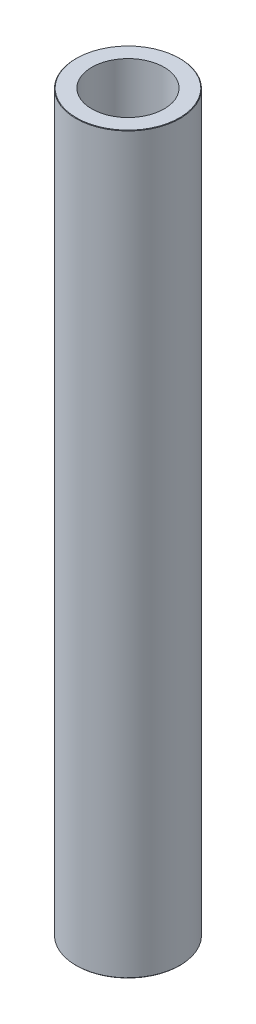
ISO-10303-21;
HEADER;
FILE_DESCRIPTION(('STEP AP214'),'2;1');
FILE_NAME('part.step','',(''),(''),'','','');
FILE_SCHEMA(('AUTOMOTIVE_DESIGN { 1 0 10303 214 1 1 1 1 }'));
ENDSEC;
DATA;
#1=APPLICATION_CONTEXT('core data for automotive mechanical design processes');
#2=APPLICATION_PROTOCOL_DEFINITION('international standard','automotive_design',2000,#1);
#3=PRODUCT_CONTEXT('',#1,'mechanical');
#4=PRODUCT('Part','Part','',(#3));
#5=PRODUCT_RELATED_PRODUCT_CATEGORY('part','',(#4));
#6=PRODUCT_DEFINITION_FORMATION('','',#4);
#7=PRODUCT_DEFINITION_CONTEXT('part definition',#1,'design');
#8=PRODUCT_DEFINITION('design','',#6,#7);
#9=PRODUCT_DEFINITION_SHAPE('','',#8);
#10=(LENGTH_UNIT() NAMED_UNIT(*) SI_UNIT(.MILLI.,.METRE.));
#11=(NAMED_UNIT(*) PLANE_ANGLE_UNIT() SI_UNIT($,.RADIAN.));
#12=(NAMED_UNIT(*) SI_UNIT($,.STERADIAN.) SOLID_ANGLE_UNIT());
#13=UNCERTAINTY_MEASURE_WITH_UNIT(LENGTH_MEASURE(1.E-05),#10,'distance_accuracy_value','');
#14=(GEOMETRIC_REPRESENTATION_CONTEXT(3) GLOBAL_UNCERTAINTY_ASSIGNED_CONTEXT((#13)) GLOBAL_UNIT_ASSIGNED_CONTEXT((#10,
#11,#12)) REPRESENTATION_CONTEXT('',''));
#15=CARTESIAN_POINT('',(0.,0.,0.));
#16=DIRECTION('',(0.,0.,1.));
#17=DIRECTION('',(1.,0.,0.));
#18=AXIS2_PLACEMENT_3D('',#15,#16,#17);
#19=CARTESIAN_POINT('',(0.,600.,0.));
#20=DIRECTION('',(0.,-1.,0.));
#21=DIRECTION('',(0.,0.,-1.));
#22=AXIS2_PLACEMENT_3D('',#19,#20,#21);
#23=CYLINDRICAL_SURFACE('',#22,42.5);
#24=CARTESIAN_POINT('',(0.,599.677769579416,0.));
#25=DIRECTION('',(0.,1.,0.));
#26=DIRECTION('',(0.,0.,1.));
#27=AXIS2_PLACEMENT_3D('',#24,#25,#26);
#28=CIRCLE('',#27,42.5);
#29=CARTESIAN_POINT('',(0.,599.677769579416,42.5));
#30=VERTEX_POINT('',#29);
#31=EDGE_CURVE('E50',#30,#30,#28,.F.);
#32=ORIENTED_EDGE('',*,*,#31,.T.);
#33=EDGE_LOOP('',(#32));
#34=FACE_BOUND('',#33,.T.);
#35=CARTESIAN_POINT('',(0.,0.38800076146317,0.));
#36=DIRECTION('',(0.,1.,0.));
#37=DIRECTION('',(0.,0.,1.));
#38=AXIS2_PLACEMENT_3D('',#35,#36,#37);
#39=CIRCLE('',#38,42.5);
#40=CARTESIAN_POINT('',(0.,0.38800076146317,42.5));
#41=VERTEX_POINT('',#40);
#42=EDGE_CURVE('E51',#41,#41,#39,.T.);
#43=ORIENTED_EDGE('',*,*,#42,.T.);
#44=EDGE_LOOP('',(#43));
#45=FACE_BOUND('',#44,.T.);
#46=ADVANCED_FACE('F39',(#34,#45),#23,.T.);
#47=CARTESIAN_POINT('',(0.,600.,0.));
#48=DIRECTION('',(0.,1.,0.));
#49=DIRECTION('',(0.,0.,1.));
#50=AXIS2_PLACEMENT_3D('',#47,#48,#49);
#51=PLANE('',#50);
#52=CARTESIAN_POINT('',(0.,600.,0.));
#53=DIRECTION('',(0.,1.,0.));
#54=DIRECTION('',(0.,0.,1.));
#55=AXIS2_PLACEMENT_3D('',#52,#53,#54);
#56=CIRCLE('',#55,42.1119992385368);
#57=CARTESIAN_POINT('',(0.,600.,42.1119992385368));
#58=VERTEX_POINT('',#57);
#59=EDGE_CURVE('E54',#58,#58,#56,.T.);
#60=ORIENTED_EDGE('',*,*,#59,.T.);
#61=EDGE_LOOP('',(#60));
#62=FACE_BOUND('',#61,.T.);
#63=CARTESIAN_POINT('',(0.,600.,0.));
#64=DIRECTION('',(0.,1.,0.));
#65=DIRECTION('',(0.,0.,1.));
#66=AXIS2_PLACEMENT_3D('',#63,#64,#65);
#67=CIRCLE('',#66,29.5408108676677);
#68=CARTESIAN_POINT('',(0.,600.,29.5408108676677));
#69=VERTEX_POINT('',#68);
#70=EDGE_CURVE('E58',#69,#69,#67,.T.);
#71=ORIENTED_EDGE('',*,*,#70,.F.);
#72=EDGE_LOOP('',(#71));
#73=FACE_BOUND('',#72,.T.);
#74=ADVANCED_FACE('F69',(#62,#73),#51,.T.);
#75=CARTESIAN_POINT('',(0.,0.,0.));
#76=DIRECTION('',(0.,1.,0.));
#77=DIRECTION('',(0.,0.,1.));
#78=AXIS2_PLACEMENT_3D('',#75,#76,#77);
#79=PLANE('',#78);
#80=CARTESIAN_POINT('',(0.,0.,0.));
#81=DIRECTION('',(0.,1.,0.));
#82=DIRECTION('',(0.,0.,1.));
#83=AXIS2_PLACEMENT_3D('',#80,#81,#82);
#84=CIRCLE('',#83,42.1777695794158);
#85=CARTESIAN_POINT('',(0.,0.,42.1777695794158));
#86=VERTEX_POINT('',#85);
#87=EDGE_CURVE('E10',#86,#86,#84,.F.);
#88=ORIENTED_EDGE('',*,*,#87,.T.);
#89=EDGE_LOOP('',(#88));
#90=FACE_BOUND('',#89,.T.);
#91=CARTESIAN_POINT('',(0.,0.,0.));
#92=DIRECTION('',(0.,1.,0.));
#93=DIRECTION('',(0.,0.,1.));
#94=AXIS2_PLACEMENT_3D('',#91,#92,#93);
#95=CIRCLE('',#94,29.5408108676677);
#96=CARTESIAN_POINT('',(0.,0.,29.5408108676677));
#97=VERTEX_POINT('',#96);
#98=EDGE_CURVE('E63',#97,#97,#95,.T.);
#99=ORIENTED_EDGE('',*,*,#98,.T.);
#100=EDGE_LOOP('',(#99));
#101=FACE_BOUND('',#100,.T.);
#102=ADVANCED_FACE('F75',(#90,#101),#79,.F.);
#103=CARTESIAN_POINT('',(0.,600.,0.));
#104=DIRECTION('',(0.,-1.,0.));
#105=DIRECTION('',(0.,0.,-1.));
#106=AXIS2_PLACEMENT_3D('',#103,#104,#105);
#107=CYLINDRICAL_SURFACE('',#106,29.5408108676677);
#108=ORIENTED_EDGE('',*,*,#70,.T.);
#109=EDGE_LOOP('',(#108));
#110=FACE_BOUND('',#109,.T.);
#111=ORIENTED_EDGE('',*,*,#98,.F.);
#112=EDGE_LOOP('',(#111));
#113=FACE_BOUND('',#112,.T.);
#114=ADVANCED_FACE('F70',(#110,#113),#107,.F.);
#115=CARTESIAN_POINT('',(0.,600.,0.));
#116=DIRECTION('',(0.,-1.,0.));
#117=DIRECTION('',(0.,0.,-1.));
#118=AXIS2_PLACEMENT_3D('',#115,#116,#117);
#119=CONICAL_SURFACE('',#118,42.1119992385368,0.877738937682816);
#120=ORIENTED_EDGE('',*,*,#31,.F.);
#121=EDGE_LOOP('',(#120));
#122=FACE_BOUND('',#121,.T.);
#123=ORIENTED_EDGE('',*,*,#59,.F.);
#124=EDGE_LOOP('',(#123));
#125=FACE_BOUND('',#124,.T.);
#126=ADVANCED_FACE('F81',(#122,#125),#119,.T.);
#127=CARTESIAN_POINT('',(0.,0.38800076146317,0.));
#128=DIRECTION('',(0.,1.,0.));
#129=DIRECTION('',(0.,0.,1.));
#130=AXIS2_PLACEMENT_3D('',#127,#128,#129);
#131=CONICAL_SURFACE('',#130,42.5,0.693057389111889);
#132=ORIENTED_EDGE('',*,*,#87,.F.);
#133=EDGE_LOOP('',(#132));
#134=FACE_BOUND('',#133,.T.);
#135=ORIENTED_EDGE('',*,*,#42,.F.);
#136=EDGE_LOOP('',(#135));
#137=FACE_BOUND('',#136,.T.);
#138=ADVANCED_FACE('F45',(#134,#137),#131,.T.);
#139=CLOSED_SHELL('',(#46,#74,#102,#114,#126,#138));
#140=MANIFOLD_SOLID_BREP('B2',#139);
#141=ADVANCED_BREP_SHAPE_REPRESENTATION('',(#18,#140),#14);
#142=SHAPE_DEFINITION_REPRESENTATION(#9,#141);
ENDSEC;
END-ISO-10303-21;
